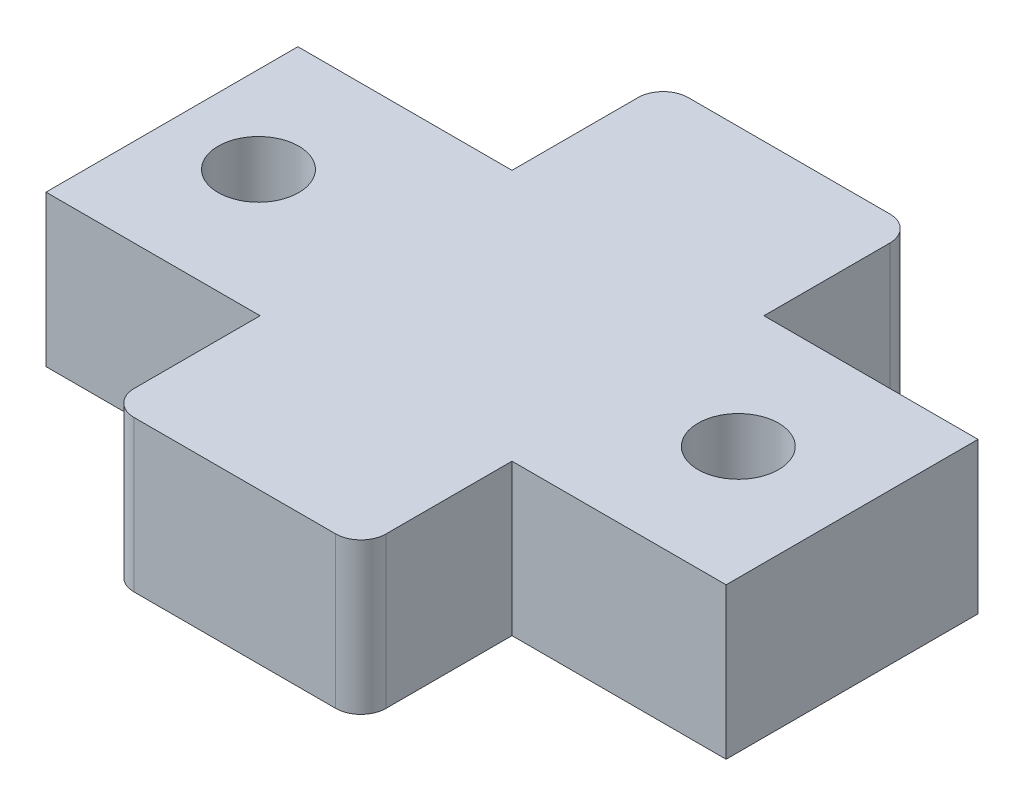
ISO-10303-21;
HEADER;
FILE_DESCRIPTION(('STEP AP214'),'2;1');
FILE_NAME('part.step','',(''),(''),'','','');
FILE_SCHEMA(('AUTOMOTIVE_DESIGN { 1 0 10303 214 1 1 1 1 }'));
ENDSEC;
DATA;
#1=APPLICATION_CONTEXT('core data for automotive mechanical design processes');
#2=APPLICATION_PROTOCOL_DEFINITION('international standard','automotive_design',2000,#1);
#3=PRODUCT_CONTEXT('',#1,'mechanical');
#4=PRODUCT('Part','Part','',(#3));
#5=PRODUCT_RELATED_PRODUCT_CATEGORY('part','',(#4));
#6=PRODUCT_DEFINITION_FORMATION('','',#4);
#7=PRODUCT_DEFINITION_CONTEXT('part definition',#1,'design');
#8=PRODUCT_DEFINITION('design','',#6,#7);
#9=PRODUCT_DEFINITION_SHAPE('','',#8);
#10=(LENGTH_UNIT() NAMED_UNIT(*) SI_UNIT(.MILLI.,.METRE.));
#11=(NAMED_UNIT(*) PLANE_ANGLE_UNIT() SI_UNIT($,.RADIAN.));
#12=(NAMED_UNIT(*) SI_UNIT($,.STERADIAN.) SOLID_ANGLE_UNIT());
#13=UNCERTAINTY_MEASURE_WITH_UNIT(LENGTH_MEASURE(1.E-05),#10,'distance_accuracy_value','');
#14=(GEOMETRIC_REPRESENTATION_CONTEXT(3) GLOBAL_UNCERTAINTY_ASSIGNED_CONTEXT((#13)) GLOBAL_UNIT_ASSIGNED_CONTEXT((#10,
#11,#12)) REPRESENTATION_CONTEXT('',''));
#15=CARTESIAN_POINT('',(0.,0.,0.));
#16=DIRECTION('',(0.,0.,1.));
#17=DIRECTION('',(1.,0.,0.));
#18=AXIS2_PLACEMENT_3D('',#15,#16,#17);
#19=CARTESIAN_POINT('',(-13.5,6.,-5.));
#20=DIRECTION('',(0.,0.,1.));
#21=DIRECTION('',(1.,0.,0.));
#22=AXIS2_PLACEMENT_3D('',#19,#20,#21);
#23=PLANE('',#22);
#24=DIRECTION('',(-1.,0.,0.));
#25=VECTOR('',#24,1.);
#26=CARTESIAN_POINT('',(-13.5,6.,-5.));
#27=LINE('',#26,#25);
#28=CARTESIAN_POINT('',(-5.,6.,-5.));
#29=VERTEX_POINT('',#28);
#30=CARTESIAN_POINT('',(-13.5,6.,-5.));
#31=VERTEX_POINT('',#30);
#32=EDGE_CURVE('E153',#29,#31,#27,.T.);
#33=ORIENTED_EDGE('',*,*,#32,.F.);
#34=DIRECTION('',(0.,-1.,0.));
#35=VECTOR('',#34,1.);
#36=CARTESIAN_POINT('',(-5.,0.,-5.));
#37=LINE('',#36,#35);
#38=CARTESIAN_POINT('',(-5.,0.,-5.));
#39=VERTEX_POINT('',#38);
#40=EDGE_CURVE('E163',#29,#39,#37,.T.);
#41=ORIENTED_EDGE('',*,*,#40,.T.);
#42=DIRECTION('',(-1.,0.,0.));
#43=VECTOR('',#42,1.);
#44=CARTESIAN_POINT('',(-13.5,0.,-5.));
#45=LINE('',#44,#43);
#46=CARTESIAN_POINT('',(-13.5,0.,-5.));
#47=VERTEX_POINT('',#46);
#48=EDGE_CURVE('E273',#39,#47,#45,.T.);
#49=ORIENTED_EDGE('',*,*,#48,.T.);
#50=DIRECTION('',(0.,-1.,0.));
#51=VECTOR('',#50,1.);
#52=CARTESIAN_POINT('',(-13.5,6.,-5.));
#53=LINE('',#52,#51);
#54=EDGE_CURVE('E172',#31,#47,#53,.T.);
#55=ORIENTED_EDGE('',*,*,#54,.F.);
#56=EDGE_LOOP('',(#33,#41,#49,#55));
#57=FACE_BOUND('',#56,.T.);
#58=ADVANCED_FACE('F33',(#57),#23,.F.);
#59=CARTESIAN_POINT('',(-13.5,6.,5.));
#60=DIRECTION('',(0.,0.,-1.));
#61=DIRECTION('',(-1.,0.,0.));
#62=AXIS2_PLACEMENT_3D('',#59,#60,#61);
#63=PLANE('',#62);
#64=DIRECTION('',(0.,-1.,0.));
#65=VECTOR('',#64,1.);
#66=CARTESIAN_POINT('',(-5.,0.,5.));
#67=LINE('',#66,#65);
#68=CARTESIAN_POINT('',(-5.,6.,5.));
#69=VERTEX_POINT('',#68);
#70=CARTESIAN_POINT('',(-5.,0.,5.));
#71=VERTEX_POINT('',#70);
#72=EDGE_CURVE('E159',#69,#71,#67,.T.);
#73=ORIENTED_EDGE('',*,*,#72,.F.);
#74=DIRECTION('',(1.,0.,0.));
#75=VECTOR('',#74,1.);
#76=CARTESIAN_POINT('',(-13.5,6.,5.));
#77=LINE('',#76,#75);
#78=CARTESIAN_POINT('',(-13.5,6.,5.));
#79=VERTEX_POINT('',#78);
#80=EDGE_CURVE('E202',#79,#69,#77,.T.);
#81=ORIENTED_EDGE('',*,*,#80,.F.);
#82=DIRECTION('',(0.,-1.,0.));
#83=VECTOR('',#82,1.);
#84=CARTESIAN_POINT('',(-13.5,6.,5.));
#85=LINE('',#84,#83);
#86=CARTESIAN_POINT('',(-13.5,0.,5.));
#87=VERTEX_POINT('',#86);
#88=EDGE_CURVE('E217',#79,#87,#85,.T.);
#89=ORIENTED_EDGE('',*,*,#88,.T.);
#90=DIRECTION('',(1.,0.,0.));
#91=VECTOR('',#90,1.);
#92=CARTESIAN_POINT('',(-13.5,0.,5.));
#93=LINE('',#92,#91);
#94=EDGE_CURVE('E181',#87,#71,#93,.T.);
#95=ORIENTED_EDGE('',*,*,#94,.T.);
#96=EDGE_LOOP('',(#73,#81,#89,#95));
#97=FACE_BOUND('',#96,.T.);
#98=ADVANCED_FACE('F359',(#97),#63,.F.);
#99=DIRECTION('',(0.,1.,0.));
#100=VECTOR('',#99,1.);
#101=CARTESIAN_POINT('',(5.,0.,5.));
#102=LINE('',#101,#100);
#103=CARTESIAN_POINT('',(5.,0.,5.));
#104=VERTEX_POINT('',#103);
#105=CARTESIAN_POINT('',(5.,6.,5.));
#106=VERTEX_POINT('',#105);
#107=EDGE_CURVE('E252',#104,#106,#102,.T.);
#108=ORIENTED_EDGE('',*,*,#107,.F.);
#109=CARTESIAN_POINT('',(13.5,0.,5.));
#110=VERTEX_POINT('',#109);
#111=EDGE_CURVE('E206',#104,#110,#93,.T.);
#112=ORIENTED_EDGE('',*,*,#111,.T.);
#113=DIRECTION('',(0.,-1.,0.));
#114=VECTOR('',#113,1.);
#115=CARTESIAN_POINT('',(13.5,6.,5.));
#116=LINE('',#115,#114);
#117=CARTESIAN_POINT('',(13.5,6.,5.));
#118=VERTEX_POINT('',#117);
#119=EDGE_CURVE('E205',#118,#110,#116,.T.);
#120=ORIENTED_EDGE('',*,*,#119,.F.);
#121=EDGE_CURVE('E193',#106,#118,#77,.T.);
#122=ORIENTED_EDGE('',*,*,#121,.F.);
#123=EDGE_LOOP('',(#108,#112,#120,#122));
#124=FACE_BOUND('',#123,.T.);
#125=ADVANCED_FACE('F355',(#124),#63,.F.);
#126=CARTESIAN_POINT('',(0.,6.,0.));
#127=DIRECTION('',(0.,1.,0.));
#128=DIRECTION('',(0.,0.,1.));
#129=AXIS2_PLACEMENT_3D('',#126,#127,#128);
#130=PLANE('',#129);
#131=DIRECTION('',(0.,0.,1.));
#132=VECTOR('',#131,1.);
#133=CARTESIAN_POINT('',(5.,6.,-11.));
#134=LINE('',#133,#132);
#135=CARTESIAN_POINT('',(5.,6.,-10.));
#136=VERTEX_POINT('',#135);
#137=CARTESIAN_POINT('',(5.,6.,-5.));
#138=VERTEX_POINT('',#137);
#139=EDGE_CURVE('E160',#136,#138,#134,.T.);
#140=ORIENTED_EDGE('',*,*,#139,.F.);
#141=CARTESIAN_POINT('',(4.,6.,-10.));
#142=DIRECTION('',(0.,1.,0.));
#143=DIRECTION('',(0.,0.,1.));
#144=AXIS2_PLACEMENT_3D('',#141,#142,#143);
#145=CIRCLE('',#144,1.);
#146=CARTESIAN_POINT('',(4.,6.,-11.));
#147=VERTEX_POINT('',#146);
#148=EDGE_CURVE('E321',#136,#147,#145,.T.);
#149=ORIENTED_EDGE('',*,*,#148,.T.);
#150=DIRECTION('',(-1.,0.,0.));
#151=VECTOR('',#150,1.);
#152=CARTESIAN_POINT('',(5.,6.,-11.));
#153=LINE('',#152,#151);
#154=CARTESIAN_POINT('',(-4.,6.,-11.));
#155=VERTEX_POINT('',#154);
#156=EDGE_CURVE('E339',#147,#155,#153,.T.);
#157=ORIENTED_EDGE('',*,*,#156,.T.);
#158=CARTESIAN_POINT('',(-4.,6.,-10.));
#159=DIRECTION('',(0.,1.,0.));
#160=DIRECTION('',(0.,0.,1.));
#161=AXIS2_PLACEMENT_3D('',#158,#159,#160);
#162=CIRCLE('',#161,1.);
#163=CARTESIAN_POINT('',(-5.,6.,-10.));
#164=VERTEX_POINT('',#163);
#165=EDGE_CURVE('E157',#155,#164,#162,.T.);
#166=ORIENTED_EDGE('',*,*,#165,.T.);
#167=DIRECTION('',(0.,0.,1.));
#168=VECTOR('',#167,1.);
#169=CARTESIAN_POINT('',(-5.,6.,-11.));
#170=LINE('',#169,#168);
#171=EDGE_CURVE('E147',#164,#29,#170,.T.);
#172=ORIENTED_EDGE('',*,*,#171,.T.);
#173=ORIENTED_EDGE('',*,*,#32,.T.);
#174=DIRECTION('',(0.,0.,1.));
#175=VECTOR('',#174,1.);
#176=CARTESIAN_POINT('',(-13.5,6.,-5.));
#177=LINE('',#176,#175);
#178=EDGE_CURVE('E178',#31,#79,#177,.T.);
#179=ORIENTED_EDGE('',*,*,#178,.T.);
#180=ORIENTED_EDGE('',*,*,#80,.T.);
#181=DIRECTION('',(0.,0.,-1.));
#182=VECTOR('',#181,1.);
#183=CARTESIAN_POINT('',(-5.,6.,11.));
#184=LINE('',#183,#182);
#185=CARTESIAN_POINT('',(-5.,6.,10.));
#186=VERTEX_POINT('',#185);
#187=EDGE_CURVE('E242',#186,#69,#184,.T.);
#188=ORIENTED_EDGE('',*,*,#187,.F.);
#189=CARTESIAN_POINT('',(-4.,6.,10.));
#190=DIRECTION('',(0.,1.,0.));
#191=DIRECTION('',(0.,0.,1.));
#192=AXIS2_PLACEMENT_3D('',#189,#190,#191);
#193=CIRCLE('',#192,1.);
#194=CARTESIAN_POINT('',(-4.,6.,11.));
#195=VERTEX_POINT('',#194);
#196=EDGE_CURVE('E236',#186,#195,#193,.T.);
#197=ORIENTED_EDGE('',*,*,#196,.T.);
#198=DIRECTION('',(-1.,0.,0.));
#199=VECTOR('',#198,1.);
#200=CARTESIAN_POINT('',(5.,6.,11.));
#201=LINE('',#200,#199);
#202=CARTESIAN_POINT('',(4.,6.,11.));
#203=VERTEX_POINT('',#202);
#204=EDGE_CURVE('E245',#203,#195,#201,.T.);
#205=ORIENTED_EDGE('',*,*,#204,.F.);
#206=CARTESIAN_POINT('',(4.,6.,10.));
#207=DIRECTION('',(0.,1.,0.));
#208=DIRECTION('',(0.,0.,1.));
#209=AXIS2_PLACEMENT_3D('',#206,#207,#208);
#210=CIRCLE('',#209,1.);
#211=CARTESIAN_POINT('',(5.,6.,10.));
#212=VERTEX_POINT('',#211);
#213=EDGE_CURVE('E260',#203,#212,#210,.T.);
#214=ORIENTED_EDGE('',*,*,#213,.T.);
#215=DIRECTION('',(0.,0.,-1.));
#216=VECTOR('',#215,1.);
#217=CARTESIAN_POINT('',(5.,6.,11.));
#218=LINE('',#217,#216);
#219=EDGE_CURVE('E244',#212,#106,#218,.T.);
#220=ORIENTED_EDGE('',*,*,#219,.T.);
#221=ORIENTED_EDGE('',*,*,#121,.T.);
#222=DIRECTION('',(0.,0.,-1.));
#223=VECTOR('',#222,1.);
#224=CARTESIAN_POINT('',(13.5,6.,-5.));
#225=LINE('',#224,#223);
#226=CARTESIAN_POINT('',(13.5,6.,-5.));
#227=VERTEX_POINT('',#226);
#228=EDGE_CURVE('E175',#118,#227,#225,.T.);
#229=ORIENTED_EDGE('',*,*,#228,.T.);
#230=EDGE_CURVE('E174',#227,#138,#27,.T.);
#231=ORIENTED_EDGE('',*,*,#230,.T.);
#232=EDGE_LOOP('',(#140,#149,#157,#166,#172,#173,#179,#180,#188,#197,#205,#214,#220,#221,#229,#231));
#233=FACE_BOUND('',#232,.T.);
#234=CARTESIAN_POINT('',(8.98500000000002,6.00000000000001,0.));
#235=DIRECTION('',(0.,-1.,0.));
#236=DIRECTION('',(0.,0.,-1.));
#237=AXIS2_PLACEMENT_3D('',#234,#235,#236);
#238=CIRCLE('',#237,1.59999999999999);
#239=CARTESIAN_POINT('',(8.98500000000002,6.00000000000001,-1.59999999999999));
#240=VERTEX_POINT('',#239);
#241=EDGE_CURVE('E276',#240,#240,#238,.T.);
#242=ORIENTED_EDGE('',*,*,#241,.T.);
#243=EDGE_LOOP('',(#242));
#244=FACE_BOUND('',#243,.T.);
#245=CARTESIAN_POINT('',(-10.065,6.00000000000001,0.));
#246=DIRECTION('',(0.,-1.,0.));
#247=DIRECTION('',(0.,0.,-1.));
#248=AXIS2_PLACEMENT_3D('',#245,#246,#247);
#249=CIRCLE('',#248,1.59999999999999);
#250=CARTESIAN_POINT('',(-10.065,6.00000000000001,-1.59999999999999));
#251=VERTEX_POINT('',#250);
#252=EDGE_CURVE('E283',#251,#251,#249,.T.);
#253=ORIENTED_EDGE('',*,*,#252,.T.);
#254=EDGE_LOOP('',(#253));
#255=FACE_BOUND('',#254,.T.);
#256=ADVANCED_FACE('F150',(#233,#244,#255),#130,.T.);
#257=CARTESIAN_POINT('',(13.5,6.,-5.));
#258=DIRECTION('',(-1.,0.,0.));
#259=DIRECTION('',(0.,0.,1.));
#260=AXIS2_PLACEMENT_3D('',#257,#258,#259);
#261=PLANE('',#260);
#262=DIRECTION('',(0.,0.,-1.));
#263=VECTOR('',#262,1.);
#264=CARTESIAN_POINT('',(13.5,0.,-5.));
#265=LINE('',#264,#263);
#266=CARTESIAN_POINT('',(13.5,0.,-5.));
#267=VERTEX_POINT('',#266);
#268=EDGE_CURVE('E196',#110,#267,#265,.T.);
#269=ORIENTED_EDGE('',*,*,#268,.T.);
#270=DIRECTION('',(0.,-1.,0.));
#271=VECTOR('',#270,1.);
#272=CARTESIAN_POINT('',(13.5,6.,-5.));
#273=LINE('',#272,#271);
#274=EDGE_CURVE('E220',#227,#267,#273,.T.);
#275=ORIENTED_EDGE('',*,*,#274,.F.);
#276=ORIENTED_EDGE('',*,*,#228,.F.);
#277=ORIENTED_EDGE('',*,*,#119,.T.);
#278=EDGE_LOOP('',(#269,#275,#276,#277));
#279=FACE_BOUND('',#278,.T.);
#280=ADVANCED_FACE('F345',(#279),#261,.F.);
#281=CARTESIAN_POINT('',(5.,0.,-5.));
#282=VERTEX_POINT('',#281);
#283=EDGE_CURVE('E272',#267,#282,#45,.T.);
#284=ORIENTED_EDGE('',*,*,#283,.T.);
#285=DIRECTION('',(0.,1.,0.));
#286=VECTOR('',#285,1.);
#287=CARTESIAN_POINT('',(5.,0.,-5.));
#288=LINE('',#287,#286);
#289=EDGE_CURVE('E169',#282,#138,#288,.T.);
#290=ORIENTED_EDGE('',*,*,#289,.T.);
#291=ORIENTED_EDGE('',*,*,#230,.F.);
#292=ORIENTED_EDGE('',*,*,#274,.T.);
#293=EDGE_LOOP('',(#284,#290,#291,#292));
#294=FACE_BOUND('',#293,.T.);
#295=ADVANCED_FACE('F341',(#294),#23,.F.);
#296=CARTESIAN_POINT('',(-13.5,6.,-5.));
#297=DIRECTION('',(1.,0.,0.));
#298=DIRECTION('',(0.,0.,-1.));
#299=AXIS2_PLACEMENT_3D('',#296,#297,#298);
#300=PLANE('',#299);
#301=DIRECTION('',(0.,0.,1.));
#302=VECTOR('',#301,1.);
#303=CARTESIAN_POINT('',(-13.5,0.,-5.));
#304=LINE('',#303,#302);
#305=EDGE_CURVE('E209',#47,#87,#304,.T.);
#306=ORIENTED_EDGE('',*,*,#305,.T.);
#307=ORIENTED_EDGE('',*,*,#88,.F.);
#308=ORIENTED_EDGE('',*,*,#178,.F.);
#309=ORIENTED_EDGE('',*,*,#54,.T.);
#310=EDGE_LOOP('',(#306,#307,#308,#309));
#311=FACE_BOUND('',#310,.T.);
#312=ADVANCED_FACE('F352',(#311),#300,.F.);
#313=CARTESIAN_POINT('',(0.,0.,0.));
#314=DIRECTION('',(0.,1.,0.));
#315=DIRECTION('',(0.,0.,1.));
#316=AXIS2_PLACEMENT_3D('',#313,#314,#315);
#317=PLANE('',#316);
#318=CARTESIAN_POINT('',(-10.065,0.,0.));
#319=DIRECTION('',(0.,-1.,0.));
#320=DIRECTION('',(0.,0.,-1.));
#321=AXIS2_PLACEMENT_3D('',#318,#319,#320);
#322=CIRCLE('',#321,1.59999999999999);
#323=CARTESIAN_POINT('',(-10.065,0.,-1.59999999999999));
#324=VERTEX_POINT('',#323);
#325=EDGE_CURVE('E265',#324,#324,#322,.T.);
#326=ORIENTED_EDGE('',*,*,#325,.F.);
#327=EDGE_LOOP('',(#326));
#328=FACE_BOUND('',#327,.T.);
#329=CARTESIAN_POINT('',(8.98500000000002,0.,0.));
#330=DIRECTION('',(0.,-1.,0.));
#331=DIRECTION('',(0.,0.,-1.));
#332=AXIS2_PLACEMENT_3D('',#329,#330,#331);
#333=CIRCLE('',#332,1.59999999999999);
#334=CARTESIAN_POINT('',(8.98500000000002,0.,-1.59999999999999));
#335=VERTEX_POINT('',#334);
#336=EDGE_CURVE('E280',#335,#335,#333,.T.);
#337=ORIENTED_EDGE('',*,*,#336,.F.);
#338=EDGE_LOOP('',(#337));
#339=FACE_BOUND('',#338,.T.);
#340=DIRECTION('',(1.,0.,0.));
#341=VECTOR('',#340,1.);
#342=CARTESIAN_POINT('',(5.,0.,-11.));
#343=LINE('',#342,#341);
#344=CARTESIAN_POINT('',(-4.,0.,-11.));
#345=VERTEX_POINT('',#344);
#346=CARTESIAN_POINT('',(4.,0.,-11.));
#347=VERTEX_POINT('',#346);
#348=EDGE_CURVE('E308',#345,#347,#343,.T.);
#349=ORIENTED_EDGE('',*,*,#348,.T.);
#350=CARTESIAN_POINT('',(4.,0.,-10.));
#351=DIRECTION('',(0.,1.,0.));
#352=DIRECTION('',(0.,0.,1.));
#353=AXIS2_PLACEMENT_3D('',#350,#351,#352);
#354=CIRCLE('',#353,1.);
#355=CARTESIAN_POINT('',(5.,0.,-10.));
#356=VERTEX_POINT('',#355);
#357=EDGE_CURVE('E41',#347,#356,#354,.F.);
#358=ORIENTED_EDGE('',*,*,#357,.T.);
#359=DIRECTION('',(0.,0.,1.));
#360=VECTOR('',#359,1.);
#361=CARTESIAN_POINT('',(5.,0.,-11.));
#362=LINE('',#361,#360);
#363=EDGE_CURVE('E316',#356,#282,#362,.T.);
#364=ORIENTED_EDGE('',*,*,#363,.T.);
#365=ORIENTED_EDGE('',*,*,#283,.F.);
#366=ORIENTED_EDGE('',*,*,#268,.F.);
#367=ORIENTED_EDGE('',*,*,#111,.F.);
#368=DIRECTION('',(0.,0.,-1.));
#369=VECTOR('',#368,1.);
#370=CARTESIAN_POINT('',(5.,0.,11.));
#371=LINE('',#370,#369);
#372=CARTESIAN_POINT('',(5.,0.,10.));
#373=VERTEX_POINT('',#372);
#374=EDGE_CURVE('E248',#373,#104,#371,.T.);
#375=ORIENTED_EDGE('',*,*,#374,.F.);
#376=CARTESIAN_POINT('',(4.,0.,10.));
#377=DIRECTION('',(0.,1.,0.));
#378=DIRECTION('',(0.,0.,1.));
#379=AXIS2_PLACEMENT_3D('',#376,#377,#378);
#380=CIRCLE('',#379,1.);
#381=CARTESIAN_POINT('',(4.,0.,11.));
#382=VERTEX_POINT('',#381);
#383=EDGE_CURVE('E267',#373,#382,#380,.F.);
#384=ORIENTED_EDGE('',*,*,#383,.T.);
#385=DIRECTION('',(1.,0.,0.));
#386=VECTOR('',#385,1.);
#387=CARTESIAN_POINT('',(5.,0.,11.));
#388=LINE('',#387,#386);
#389=CARTESIAN_POINT('',(-4.,0.,11.));
#390=VERTEX_POINT('',#389);
#391=EDGE_CURVE('E299',#390,#382,#388,.T.);
#392=ORIENTED_EDGE('',*,*,#391,.F.);
#393=CARTESIAN_POINT('',(-4.,0.,10.));
#394=DIRECTION('',(0.,1.,0.));
#395=DIRECTION('',(0.,0.,1.));
#396=AXIS2_PLACEMENT_3D('',#393,#394,#395);
#397=CIRCLE('',#396,1.);
#398=CARTESIAN_POINT('',(-5.,0.,10.));
#399=VERTEX_POINT('',#398);
#400=EDGE_CURVE('E263',#390,#399,#397,.F.);
#401=ORIENTED_EDGE('',*,*,#400,.T.);
#402=DIRECTION('',(0.,0.,-1.));
#403=VECTOR('',#402,1.);
#404=CARTESIAN_POINT('',(-5.,0.,11.));
#405=LINE('',#404,#403);
#406=EDGE_CURVE('E259',#399,#71,#405,.T.);
#407=ORIENTED_EDGE('',*,*,#406,.T.);
#408=ORIENTED_EDGE('',*,*,#94,.F.);
#409=ORIENTED_EDGE('',*,*,#305,.F.);
#410=ORIENTED_EDGE('',*,*,#48,.F.);
#411=DIRECTION('',(0.,0.,1.));
#412=VECTOR('',#411,1.);
#413=CARTESIAN_POINT('',(-5.,0.,-11.));
#414=LINE('',#413,#412);
#415=CARTESIAN_POINT('',(-5.,0.,-10.));
#416=VERTEX_POINT('',#415);
#417=EDGE_CURVE('E166',#416,#39,#414,.T.);
#418=ORIENTED_EDGE('',*,*,#417,.F.);
#419=CARTESIAN_POINT('',(-4.,0.,-10.));
#420=DIRECTION('',(0.,1.,0.));
#421=DIRECTION('',(0.,0.,1.));
#422=AXIS2_PLACEMENT_3D('',#419,#420,#421);
#423=CIRCLE('',#422,1.);
#424=EDGE_CURVE('E48',#416,#345,#423,.F.);
#425=ORIENTED_EDGE('',*,*,#424,.T.);
#426=EDGE_LOOP('',(#349,#358,#364,#365,#366,#367,#375,#384,#392,#401,#407,#408,#409,#410,#418,#425));
#427=FACE_BOUND('',#426,.T.);
#428=ADVANCED_FACE('F330',(#328,#339,#427),#317,.F.);
#429=CARTESIAN_POINT('',(8.98500000000002,0.,0.));
#430=DIRECTION('',(0.,-1.,0.));
#431=DIRECTION('',(0.,0.,-1.));
#432=AXIS2_PLACEMENT_3D('',#429,#430,#431);
#433=CYLINDRICAL_SURFACE('',#432,1.59999999999999);
#434=ORIENTED_EDGE('',*,*,#241,.F.);
#435=EDGE_LOOP('',(#434));
#436=FACE_BOUND('',#435,.T.);
#437=ORIENTED_EDGE('',*,*,#336,.T.);
#438=EDGE_LOOP('',(#437));
#439=FACE_BOUND('',#438,.T.);
#440=ADVANCED_FACE('F372',(#436,#439),#433,.F.);
#441=CARTESIAN_POINT('',(-10.065,0.,0.));
#442=DIRECTION('',(0.,-1.,0.));
#443=DIRECTION('',(0.,0.,-1.));
#444=AXIS2_PLACEMENT_3D('',#441,#442,#443);
#445=CYLINDRICAL_SURFACE('',#444,1.59999999999999);
#446=ORIENTED_EDGE('',*,*,#252,.F.);
#447=EDGE_LOOP('',(#446));
#448=FACE_BOUND('',#447,.T.);
#449=ORIENTED_EDGE('',*,*,#325,.T.);
#450=EDGE_LOOP('',(#449));
#451=FACE_BOUND('',#450,.T.);
#452=ADVANCED_FACE('F377',(#448,#451),#445,.F.);
#453=CARTESIAN_POINT('',(-5.,0.,11.));
#454=DIRECTION('',(1.,0.,0.));
#455=DIRECTION('',(0.,1.,0.));
#456=AXIS2_PLACEMENT_3D('',#453,#454,#455);
#457=PLANE('',#456);
#458=ORIENTED_EDGE('',*,*,#406,.F.);
#459=DIRECTION('',(0.,-1.,0.));
#460=VECTOR('',#459,1.);
#461=CARTESIAN_POINT('',(-5.,6.,10.));
#462=LINE('',#461,#460);
#463=EDGE_CURVE('E269',#399,#186,#462,.F.);
#464=ORIENTED_EDGE('',*,*,#463,.T.);
#465=ORIENTED_EDGE('',*,*,#187,.T.);
#466=ORIENTED_EDGE('',*,*,#72,.T.);
#467=EDGE_LOOP('',(#458,#464,#465,#466));
#468=FACE_BOUND('',#467,.T.);
#469=ADVANCED_FACE('F381',(#468),#457,.F.);
#470=CARTESIAN_POINT('',(5.,0.,11.));
#471=DIRECTION('',(-1.,0.,0.));
#472=DIRECTION('',(0.,-1.,0.));
#473=AXIS2_PLACEMENT_3D('',#470,#471,#472);
#474=PLANE('',#473);
#475=ORIENTED_EDGE('',*,*,#219,.F.);
#476=DIRECTION('',(0.,1.,0.));
#477=VECTOR('',#476,1.);
#478=CARTESIAN_POINT('',(5.,0.,10.));
#479=LINE('',#478,#477);
#480=EDGE_CURVE('E261',#212,#373,#479,.F.);
#481=ORIENTED_EDGE('',*,*,#480,.T.);
#482=ORIENTED_EDGE('',*,*,#374,.T.);
#483=ORIENTED_EDGE('',*,*,#107,.T.);
#484=EDGE_LOOP('',(#475,#481,#482,#483));
#485=FACE_BOUND('',#484,.T.);
#486=ADVANCED_FACE('F385',(#485),#474,.F.);
#487=CARTESIAN_POINT('',(0.,0.,11.));
#488=DIRECTION('',(0.,0.,1.));
#489=DIRECTION('',(1.,0.,0.));
#490=AXIS2_PLACEMENT_3D('',#487,#488,#489);
#491=PLANE('',#490);
#492=ORIENTED_EDGE('',*,*,#391,.T.);
#493=DIRECTION('',(0.,1.,0.));
#494=VECTOR('',#493,1.);
#495=CARTESIAN_POINT('',(4.,6.,11.));
#496=LINE('',#495,#494);
#497=EDGE_CURVE('E228',#382,#203,#496,.T.);
#498=ORIENTED_EDGE('',*,*,#497,.T.);
#499=ORIENTED_EDGE('',*,*,#204,.T.);
#500=DIRECTION('',(0.,-1.,0.));
#501=VECTOR('',#500,1.);
#502=CARTESIAN_POINT('',(-4.,0.,11.));
#503=LINE('',#502,#501);
#504=EDGE_CURVE('E222',#195,#390,#503,.T.);
#505=ORIENTED_EDGE('',*,*,#504,.T.);
#506=EDGE_LOOP('',(#492,#498,#499,#505));
#507=FACE_BOUND('',#506,.T.);
#508=ADVANCED_FACE('F388',(#507),#491,.T.);
#509=CARTESIAN_POINT('',(4.,0.,10.));
#510=DIRECTION('',(0.,-1.,0.));
#511=DIRECTION('',(1.,0.,0.));
#512=AXIS2_PLACEMENT_3D('',#509,#510,#511);
#513=CYLINDRICAL_SURFACE('',#512,1.);
#514=ORIENTED_EDGE('',*,*,#383,.F.);
#515=ORIENTED_EDGE('',*,*,#480,.F.);
#516=ORIENTED_EDGE('',*,*,#213,.F.);
#517=ORIENTED_EDGE('',*,*,#497,.F.);
#518=EDGE_LOOP('',(#514,#515,#516,#517));
#519=FACE_BOUND('',#518,.T.);
#520=ADVANCED_FACE('F391',(#519),#513,.T.);
#521=CARTESIAN_POINT('',(-4.,0.,10.));
#522=DIRECTION('',(0.,1.,0.));
#523=DIRECTION('',(-1.,0.,0.));
#524=AXIS2_PLACEMENT_3D('',#521,#522,#523);
#525=CYLINDRICAL_SURFACE('',#524,1.);
#526=ORIENTED_EDGE('',*,*,#196,.F.);
#527=ORIENTED_EDGE('',*,*,#463,.F.);
#528=ORIENTED_EDGE('',*,*,#400,.F.);
#529=ORIENTED_EDGE('',*,*,#504,.F.);
#530=EDGE_LOOP('',(#526,#527,#528,#529));
#531=FACE_BOUND('',#530,.T.);
#532=ADVANCED_FACE('F394',(#531),#525,.T.);
#533=CARTESIAN_POINT('',(-5.,0.,-11.));
#534=DIRECTION('',(-1.,0.,0.));
#535=DIRECTION('',(0.,-1.,0.));
#536=AXIS2_PLACEMENT_3D('',#533,#534,#535);
#537=PLANE('',#536);
#538=ORIENTED_EDGE('',*,*,#171,.F.);
#539=DIRECTION('',(0.,-1.,0.));
#540=VECTOR('',#539,1.);
#541=CARTESIAN_POINT('',(-5.,0.,-10.));
#542=LINE('',#541,#540);
#543=EDGE_CURVE('E11',#164,#416,#542,.T.);
#544=ORIENTED_EDGE('',*,*,#543,.T.);
#545=ORIENTED_EDGE('',*,*,#417,.T.);
#546=ORIENTED_EDGE('',*,*,#40,.F.);
#547=EDGE_LOOP('',(#538,#544,#545,#546));
#548=FACE_BOUND('',#547,.T.);
#549=ADVANCED_FACE('F164',(#548),#537,.T.);
#550=CARTESIAN_POINT('',(5.,0.,-11.));
#551=DIRECTION('',(1.,0.,0.));
#552=DIRECTION('',(0.,1.,0.));
#553=AXIS2_PLACEMENT_3D('',#550,#551,#552);
#554=PLANE('',#553);
#555=ORIENTED_EDGE('',*,*,#363,.F.);
#556=DIRECTION('',(0.,1.,0.));
#557=VECTOR('',#556,1.);
#558=CARTESIAN_POINT('',(5.,0.,-10.));
#559=LINE('',#558,#557);
#560=EDGE_CURVE('E271',#356,#136,#559,.T.);
#561=ORIENTED_EDGE('',*,*,#560,.T.);
#562=ORIENTED_EDGE('',*,*,#139,.T.);
#563=ORIENTED_EDGE('',*,*,#289,.F.);
#564=EDGE_LOOP('',(#555,#561,#562,#563));
#565=FACE_BOUND('',#564,.T.);
#566=ADVANCED_FACE('F336',(#565),#554,.T.);
#567=CARTESIAN_POINT('',(0.,0.,-11.));
#568=DIRECTION('',(0.,0.,-1.));
#569=DIRECTION('',(1.,0.,0.));
#570=AXIS2_PLACEMENT_3D('',#567,#568,#569);
#571=PLANE('',#570);
#572=ORIENTED_EDGE('',*,*,#156,.F.);
#573=DIRECTION('',(0.,1.,0.));
#574=VECTOR('',#573,1.);
#575=CARTESIAN_POINT('',(4.,0.,-11.));
#576=LINE('',#575,#574);
#577=EDGE_CURVE('E55',#147,#347,#576,.F.);
#578=ORIENTED_EDGE('',*,*,#577,.T.);
#579=ORIENTED_EDGE('',*,*,#348,.F.);
#580=DIRECTION('',(0.,-1.,0.));
#581=VECTOR('',#580,1.);
#582=CARTESIAN_POINT('',(-4.,0.,-11.));
#583=LINE('',#582,#581);
#584=EDGE_CURVE('E323',#345,#155,#583,.F.);
#585=ORIENTED_EDGE('',*,*,#584,.T.);
#586=EDGE_LOOP('',(#572,#578,#579,#585));
#587=FACE_BOUND('',#586,.T.);
#588=ADVANCED_FACE('F340',(#587),#571,.T.);
#589=CARTESIAN_POINT('',(4.,0.,-10.));
#590=DIRECTION('',(0.,1.,0.));
#591=DIRECTION('',(-1.,0.,0.));
#592=AXIS2_PLACEMENT_3D('',#589,#590,#591);
#593=CYLINDRICAL_SURFACE('',#592,1.);
#594=ORIENTED_EDGE('',*,*,#357,.F.);
#595=ORIENTED_EDGE('',*,*,#577,.F.);
#596=ORIENTED_EDGE('',*,*,#148,.F.);
#597=ORIENTED_EDGE('',*,*,#560,.F.);
#598=EDGE_LOOP('',(#594,#595,#596,#597));
#599=FACE_BOUND('',#598,.T.);
#600=ADVANCED_FACE('F338',(#599),#593,.T.);
#601=CARTESIAN_POINT('',(-4.,0.,-10.));
#602=DIRECTION('',(0.,-1.,0.));
#603=DIRECTION('',(1.,0.,0.));
#604=AXIS2_PLACEMENT_3D('',#601,#602,#603);
#605=CYLINDRICAL_SURFACE('',#604,1.);
#606=ORIENTED_EDGE('',*,*,#165,.F.);
#607=ORIENTED_EDGE('',*,*,#584,.F.);
#608=ORIENTED_EDGE('',*,*,#424,.F.);
#609=ORIENTED_EDGE('',*,*,#543,.F.);
#610=EDGE_LOOP('',(#606,#607,#608,#609));
#611=FACE_BOUND('',#610,.T.);
#612=ADVANCED_FACE('F35',(#611),#605,.T.);
#613=CLOSED_SHELL('',(#58,#98,#125,#256,#280,#295,#312,#428,#440,#452,#469,#486,#508,#520,#532,
#549,#566,#588,#600,#612));
#614=MANIFOLD_SOLID_BREP('B2',#613);
#615=ADVANCED_BREP_SHAPE_REPRESENTATION('',(#18,#614),#14);
#616=SHAPE_DEFINITION_REPRESENTATION(#9,#615);
ENDSEC;
END-ISO-10303-21;
